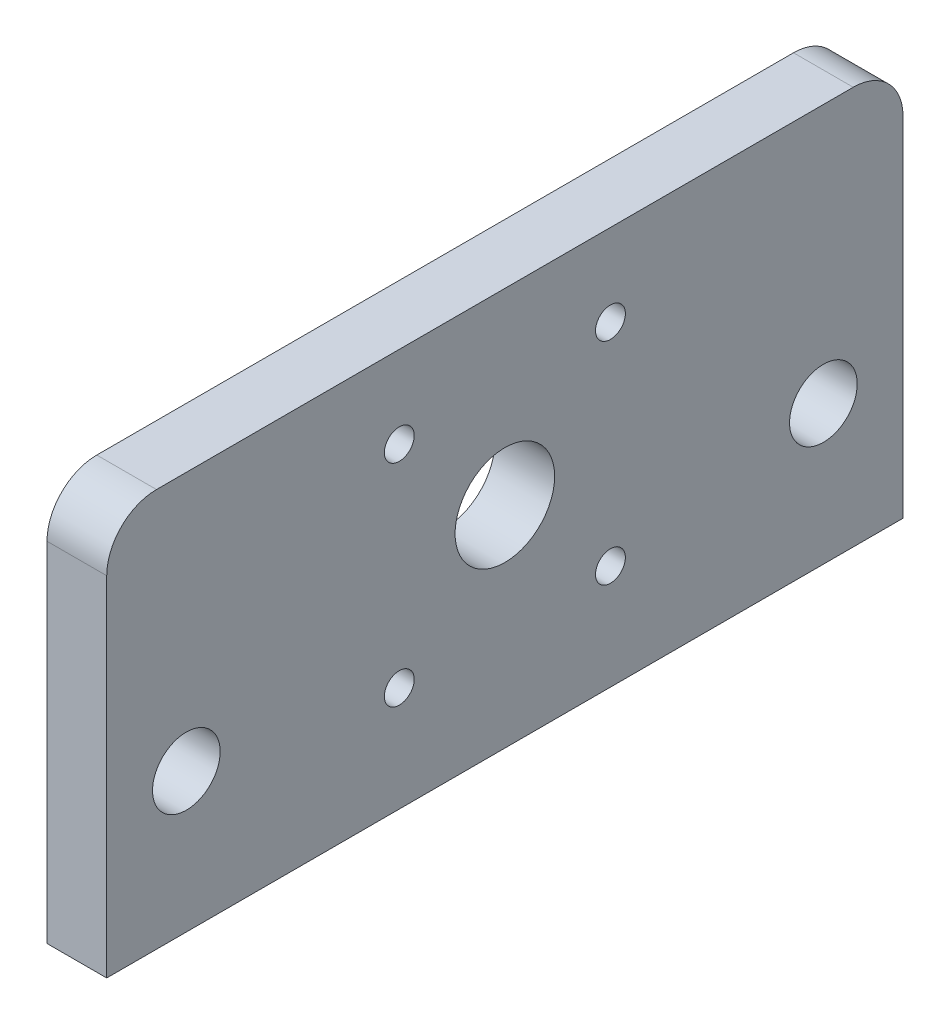
ISO-10303-21;
HEADER;
FILE_DESCRIPTION(('STEP AP214'),'2;1');
FILE_NAME('part.step','',(''),(''),'','','');
FILE_SCHEMA(('AUTOMOTIVE_DESIGN { 1 0 10303 214 1 1 1 1 }'));
ENDSEC;
DATA;
#1=APPLICATION_CONTEXT('core data for automotive mechanical design processes');
#2=APPLICATION_PROTOCOL_DEFINITION('international standard','automotive_design',2000,#1);
#3=PRODUCT_CONTEXT('',#1,'mechanical');
#4=PRODUCT('Part','Part','',(#3));
#5=PRODUCT_RELATED_PRODUCT_CATEGORY('part','',(#4));
#6=PRODUCT_DEFINITION_FORMATION('','',#4);
#7=PRODUCT_DEFINITION_CONTEXT('part definition',#1,'design');
#8=PRODUCT_DEFINITION('design','',#6,#7);
#9=PRODUCT_DEFINITION_SHAPE('','',#8);
#10=(LENGTH_UNIT() NAMED_UNIT(*) SI_UNIT(.MILLI.,.METRE.));
#11=(NAMED_UNIT(*) PLANE_ANGLE_UNIT() SI_UNIT($,.RADIAN.));
#12=(NAMED_UNIT(*) SI_UNIT($,.STERADIAN.) SOLID_ANGLE_UNIT());
#13=UNCERTAINTY_MEASURE_WITH_UNIT(LENGTH_MEASURE(1.E-05),#10,'distance_accuracy_value','');
#14=(GEOMETRIC_REPRESENTATION_CONTEXT(3) GLOBAL_UNCERTAINTY_ASSIGNED_CONTEXT((#13)) GLOBAL_UNIT_ASSIGNED_CONTEXT((#10,
#11,#12)) REPRESENTATION_CONTEXT('',''));
#15=CARTESIAN_POINT('',(0.,0.,0.));
#16=DIRECTION('',(0.,0.,1.));
#17=DIRECTION('',(1.,0.,0.));
#18=AXIS2_PLACEMENT_3D('',#15,#16,#17);
#19=CARTESIAN_POINT('',(-6.,20.,-40.));
#20=DIRECTION('',(0.,0.,-1.));
#21=DIRECTION('',(0.,1.,0.));
#22=AXIS2_PLACEMENT_3D('',#19,#20,#21);
#23=PLANE('',#22);
#24=DIRECTION('',(0.,1.,0.));
#25=VECTOR('',#24,1.);
#26=CARTESIAN_POINT('',(-6.,20.,-40.));
#27=LINE('',#26,#25);
#28=CARTESIAN_POINT('',(-6.,-20.,-40.));
#29=VERTEX_POINT('',#28);
#30=CARTESIAN_POINT('',(-6.,15.,-40.));
#31=VERTEX_POINT('',#30);
#32=EDGE_CURVE('E108',#29,#31,#27,.T.);
#33=ORIENTED_EDGE('',*,*,#32,.T.);
#34=DIRECTION('',(1.,0.,0.));
#35=VECTOR('',#34,1.);
#36=CARTESIAN_POINT('',(-6.,15.,-40.));
#37=LINE('',#36,#35);
#38=CARTESIAN_POINT('',(0.,15.,-40.));
#39=VERTEX_POINT('',#38);
#40=EDGE_CURVE('E122',#31,#39,#37,.T.);
#41=ORIENTED_EDGE('',*,*,#40,.T.);
#42=DIRECTION('',(0.,1.,0.));
#43=VECTOR('',#42,1.);
#44=CARTESIAN_POINT('',(0.,20.,-40.));
#45=LINE('',#44,#43);
#46=CARTESIAN_POINT('',(0.,-20.,-40.));
#47=VERTEX_POINT('',#46);
#48=EDGE_CURVE('E112',#47,#39,#45,.T.);
#49=ORIENTED_EDGE('',*,*,#48,.F.);
#50=DIRECTION('',(1.,0.,0.));
#51=VECTOR('',#50,1.);
#52=CARTESIAN_POINT('',(-6.,-20.,-40.));
#53=LINE('',#52,#51);
#54=EDGE_CURVE('E103',#29,#47,#53,.T.);
#55=ORIENTED_EDGE('',*,*,#54,.F.);
#56=EDGE_LOOP('',(#33,#41,#49,#55));
#57=FACE_BOUND('',#56,.T.);
#58=ADVANCED_FACE('F38',(#57),#23,.T.);
#59=CARTESIAN_POINT('',(-6.,-20.,40.));
#60=DIRECTION('',(0.,-1.,0.));
#61=DIRECTION('',(0.,0.,-1.));
#62=AXIS2_PLACEMENT_3D('',#59,#60,#61);
#63=PLANE('',#62);
#64=DIRECTION('',(0.,0.,-1.));
#65=VECTOR('',#64,1.);
#66=CARTESIAN_POINT('',(0.,-20.,40.));
#67=LINE('',#66,#65);
#68=CARTESIAN_POINT('',(0.,-20.,40.));
#69=VERTEX_POINT('',#68);
#70=EDGE_CURVE('E102',#69,#47,#67,.T.);
#71=ORIENTED_EDGE('',*,*,#70,.F.);
#72=DIRECTION('',(1.,0.,0.));
#73=VECTOR('',#72,1.);
#74=CARTESIAN_POINT('',(-6.,-20.,40.));
#75=LINE('',#74,#73);
#76=CARTESIAN_POINT('',(-6.,-20.,40.));
#77=VERTEX_POINT('',#76);
#78=EDGE_CURVE('E92',#77,#69,#75,.T.);
#79=ORIENTED_EDGE('',*,*,#78,.F.);
#80=DIRECTION('',(0.,0.,-1.));
#81=VECTOR('',#80,1.);
#82=CARTESIAN_POINT('',(-6.,-20.,40.));
#83=LINE('',#82,#81);
#84=EDGE_CURVE('E95',#77,#29,#83,.T.);
#85=ORIENTED_EDGE('',*,*,#84,.T.);
#86=ORIENTED_EDGE('',*,*,#54,.T.);
#87=EDGE_LOOP('',(#71,#79,#85,#86));
#88=FACE_BOUND('',#87,.T.);
#89=ADVANCED_FACE('F100',(#88),#63,.T.);
#90=CARTESIAN_POINT('',(-6.,20.,40.));
#91=DIRECTION('',(0.,0.,1.));
#92=DIRECTION('',(0.,-1.,0.));
#93=AXIS2_PLACEMENT_3D('',#90,#91,#92);
#94=PLANE('',#93);
#95=DIRECTION('',(0.,-1.,0.));
#96=VECTOR('',#95,1.);
#97=CARTESIAN_POINT('',(0.,20.,40.));
#98=LINE('',#97,#96);
#99=CARTESIAN_POINT('',(0.,15.,40.));
#100=VERTEX_POINT('',#99);
#101=EDGE_CURVE('E119',#100,#69,#98,.T.);
#102=ORIENTED_EDGE('',*,*,#101,.F.);
#103=DIRECTION('',(1.,0.,0.));
#104=VECTOR('',#103,1.);
#105=CARTESIAN_POINT('',(-6.,15.,40.));
#106=LINE('',#105,#104);
#107=CARTESIAN_POINT('',(-6.,15.,40.));
#108=VERTEX_POINT('',#107);
#109=EDGE_CURVE('E11',#100,#108,#106,.F.);
#110=ORIENTED_EDGE('',*,*,#109,.T.);
#111=DIRECTION('',(0.,-1.,0.));
#112=VECTOR('',#111,1.);
#113=CARTESIAN_POINT('',(-6.,20.,40.));
#114=LINE('',#113,#112);
#115=EDGE_CURVE('E89',#108,#77,#114,.T.);
#116=ORIENTED_EDGE('',*,*,#115,.T.);
#117=ORIENTED_EDGE('',*,*,#78,.T.);
#118=EDGE_LOOP('',(#102,#110,#116,#117));
#119=FACE_BOUND('',#118,.T.);
#120=ADVANCED_FACE('F91',(#119),#94,.T.);
#121=CARTESIAN_POINT('',(-6.,20.,40.));
#122=DIRECTION('',(0.,1.,0.));
#123=DIRECTION('',(0.,0.,1.));
#124=AXIS2_PLACEMENT_3D('',#121,#122,#123);
#125=PLANE('',#124);
#126=DIRECTION('',(0.,0.,1.));
#127=VECTOR('',#126,1.);
#128=CARTESIAN_POINT('',(0.,20.,40.));
#129=LINE('',#128,#127);
#130=CARTESIAN_POINT('',(0.,20.,-35.));
#131=VERTEX_POINT('',#130);
#132=CARTESIAN_POINT('',(0.,20.,35.));
#133=VERTEX_POINT('',#132);
#134=EDGE_CURVE('E115',#131,#133,#129,.T.);
#135=ORIENTED_EDGE('',*,*,#134,.F.);
#136=DIRECTION('',(1.,0.,0.));
#137=VECTOR('',#136,1.);
#138=CARTESIAN_POINT('',(-6.,20.,-35.));
#139=LINE('',#138,#137);
#140=CARTESIAN_POINT('',(-6.,20.,-35.));
#141=VERTEX_POINT('',#140);
#142=EDGE_CURVE('E133',#131,#141,#139,.F.);
#143=ORIENTED_EDGE('',*,*,#142,.T.);
#144=DIRECTION('',(0.,0.,1.));
#145=VECTOR('',#144,1.);
#146=CARTESIAN_POINT('',(-6.,20.,40.));
#147=LINE('',#146,#145);
#148=CARTESIAN_POINT('',(-6.,20.,35.));
#149=VERTEX_POINT('',#148);
#150=EDGE_CURVE('E96',#141,#149,#147,.T.);
#151=ORIENTED_EDGE('',*,*,#150,.T.);
#152=DIRECTION('',(1.,0.,0.));
#153=VECTOR('',#152,1.);
#154=CARTESIAN_POINT('',(-6.,20.,35.));
#155=LINE('',#154,#153);
#156=EDGE_CURVE('E130',#149,#133,#155,.T.);
#157=ORIENTED_EDGE('',*,*,#156,.T.);
#158=EDGE_LOOP('',(#135,#143,#151,#157));
#159=FACE_BOUND('',#158,.T.);
#160=ADVANCED_FACE('F147',(#159),#125,.T.);
#161=CARTESIAN_POINT('',(-6.,0.,0.));
#162=DIRECTION('',(1.,0.,0.));
#163=DIRECTION('',(0.,0.,-1.));
#164=AXIS2_PLACEMENT_3D('',#161,#162,#163);
#165=PLANE('',#164);
#166=CARTESIAN_POINT('',(-6.,11.7566017177983,10.6066017177982));
#167=DIRECTION('',(1.,0.,0.));
#168=DIRECTION('',(0.,0.,-1.));
#169=AXIS2_PLACEMENT_3D('',#166,#167,#168);
#170=CIRCLE('',#169,1.49999999999996);
#171=CARTESIAN_POINT('',(-6.,11.7566017177983,9.1066017177982));
#172=VERTEX_POINT('',#171);
#173=EDGE_CURVE('E116',#172,#172,#170,.T.);
#174=ORIENTED_EDGE('',*,*,#173,.T.);
#175=EDGE_LOOP('',(#174));
#176=FACE_BOUND('',#175,.T.);
#177=CARTESIAN_POINT('',(-6.,11.7566017177982,-10.6066017177982));
#178=DIRECTION('',(1.,0.,0.));
#179=DIRECTION('',(0.,0.,-1.));
#180=AXIS2_PLACEMENT_3D('',#177,#178,#179);
#181=CIRCLE('',#180,1.5);
#182=CARTESIAN_POINT('',(-6.,11.7566017177982,-12.1066017177982));
#183=VERTEX_POINT('',#182);
#184=EDGE_CURVE('E221',#183,#183,#181,.T.);
#185=ORIENTED_EDGE('',*,*,#184,.T.);
#186=EDGE_LOOP('',(#185));
#187=FACE_BOUND('',#186,.T.);
#188=CARTESIAN_POINT('',(-6.,-9.45660171779821,-10.6066017177982));
#189=DIRECTION('',(1.,0.,0.));
#190=DIRECTION('',(0.,0.,-1.));
#191=AXIS2_PLACEMENT_3D('',#188,#189,#190);
#192=CIRCLE('',#191,1.5);
#193=CARTESIAN_POINT('',(-6.,-9.45660171779821,-12.1066017177982));
#194=VERTEX_POINT('',#193);
#195=EDGE_CURVE('E212',#194,#194,#192,.T.);
#196=ORIENTED_EDGE('',*,*,#195,.T.);
#197=EDGE_LOOP('',(#196));
#198=FACE_BOUND('',#197,.T.);
#199=CARTESIAN_POINT('',(-6.,-9.45660171779823,10.6066017177982));
#200=DIRECTION('',(1.,0.,0.));
#201=DIRECTION('',(0.,0.,-1.));
#202=AXIS2_PLACEMENT_3D('',#199,#200,#201);
#203=CIRCLE('',#202,1.49999999999999);
#204=CARTESIAN_POINT('',(-6.,-9.45660171779823,9.10660171779823));
#205=VERTEX_POINT('',#204);
#206=EDGE_CURVE('E208',#205,#205,#203,.T.);
#207=ORIENTED_EDGE('',*,*,#206,.T.);
#208=EDGE_LOOP('',(#207));
#209=FACE_BOUND('',#208,.T.);
#210=CARTESIAN_POINT('',(-6.,-6.00000000000001,-32.));
#211=DIRECTION('',(1.,0.,0.));
#212=DIRECTION('',(0.,0.,-1.));
#213=AXIS2_PLACEMENT_3D('',#210,#211,#212);
#214=CIRCLE('',#213,3.4);
#215=CARTESIAN_POINT('',(-6.,-6.00000000000001,-35.4));
#216=VERTEX_POINT('',#215);
#217=EDGE_CURVE('E206',#216,#216,#214,.T.);
#218=ORIENTED_EDGE('',*,*,#217,.T.);
#219=EDGE_LOOP('',(#218));
#220=FACE_BOUND('',#219,.T.);
#221=CARTESIAN_POINT('',(-6.,-6.00000000000001,32.));
#222=DIRECTION('',(1.,0.,0.));
#223=DIRECTION('',(0.,0.,-1.));
#224=AXIS2_PLACEMENT_3D('',#221,#222,#223);
#225=CIRCLE('',#224,3.4);
#226=CARTESIAN_POINT('',(-6.,-6.00000000000001,28.6));
#227=VERTEX_POINT('',#226);
#228=EDGE_CURVE('E209',#227,#227,#225,.T.);
#229=ORIENTED_EDGE('',*,*,#228,.T.);
#230=EDGE_LOOP('',(#229));
#231=FACE_BOUND('',#230,.T.);
#232=CARTESIAN_POINT('',(-6.,1.14999999999999,0.));
#233=DIRECTION('',(1.,0.,0.));
#234=DIRECTION('',(0.,0.,-1.));
#235=AXIS2_PLACEMENT_3D('',#232,#233,#234);
#236=CIRCLE('',#235,5.);
#237=CARTESIAN_POINT('',(-6.,1.14999999999999,-4.99999999999999));
#238=VERTEX_POINT('',#237);
#239=EDGE_CURVE('E215',#238,#238,#236,.T.);
#240=ORIENTED_EDGE('',*,*,#239,.T.);
#241=EDGE_LOOP('',(#240));
#242=FACE_BOUND('',#241,.T.);
#243=ORIENTED_EDGE('',*,*,#150,.F.);
#244=CARTESIAN_POINT('',(-6.,15.,-35.));
#245=DIRECTION('',(1.,0.,0.));
#246=DIRECTION('',(0.,0.,-1.));
#247=AXIS2_PLACEMENT_3D('',#244,#245,#246);
#248=CIRCLE('',#247,5.);
#249=EDGE_CURVE('E46',#141,#31,#248,.F.);
#250=ORIENTED_EDGE('',*,*,#249,.T.);
#251=ORIENTED_EDGE('',*,*,#32,.F.);
#252=ORIENTED_EDGE('',*,*,#84,.F.);
#253=ORIENTED_EDGE('',*,*,#115,.F.);
#254=CARTESIAN_POINT('',(-6.,15.,35.));
#255=DIRECTION('',(1.,0.,0.));
#256=DIRECTION('',(0.,0.,-1.));
#257=AXIS2_PLACEMENT_3D('',#254,#255,#256);
#258=CIRCLE('',#257,5.);
#259=EDGE_CURVE('E58',#108,#149,#258,.F.);
#260=ORIENTED_EDGE('',*,*,#259,.T.);
#261=EDGE_LOOP('',(#243,#250,#251,#252,#253,#260));
#262=FACE_BOUND('',#261,.T.);
#263=ADVANCED_FACE('F106',(#176,#187,#198,#209,#220,#231,#242,#262),#165,.F.);
#264=CARTESIAN_POINT('',(0.,0.,0.));
#265=DIRECTION('',(1.,0.,0.));
#266=DIRECTION('',(0.,0.,-1.));
#267=AXIS2_PLACEMENT_3D('',#264,#265,#266);
#268=PLANE('',#267);
#269=CARTESIAN_POINT('',(0.,11.7566017177983,10.6066017177982));
#270=DIRECTION('',(1.,0.,0.));
#271=DIRECTION('',(0.,0.,-1.));
#272=AXIS2_PLACEMENT_3D('',#269,#270,#271);
#273=CIRCLE('',#272,1.49999999999996);
#274=CARTESIAN_POINT('',(0.,11.7566017177983,9.1066017177982));
#275=VERTEX_POINT('',#274);
#276=EDGE_CURVE('E241',#275,#275,#273,.T.);
#277=ORIENTED_EDGE('',*,*,#276,.F.);
#278=EDGE_LOOP('',(#277));
#279=FACE_BOUND('',#278,.T.);
#280=CARTESIAN_POINT('',(0.,11.7566017177982,-10.6066017177982));
#281=DIRECTION('',(1.,0.,0.));
#282=DIRECTION('',(0.,0.,1.));
#283=AXIS2_PLACEMENT_3D('',#280,#281,#282);
#284=CIRCLE('',#283,1.5);
#285=CARTESIAN_POINT('',(0.,11.7566017177982,-9.10660171779819));
#286=VERTEX_POINT('',#285);
#287=EDGE_CURVE('E250',#286,#286,#284,.T.);
#288=ORIENTED_EDGE('',*,*,#287,.F.);
#289=EDGE_LOOP('',(#288));
#290=FACE_BOUND('',#289,.T.);
#291=CARTESIAN_POINT('',(0.,-9.45660171779821,-10.6066017177982));
#292=DIRECTION('',(1.,0.,0.));
#293=DIRECTION('',(0.,0.,-1.));
#294=AXIS2_PLACEMENT_3D('',#291,#292,#293);
#295=CIRCLE('',#294,1.5);
#296=CARTESIAN_POINT('',(0.,-9.45660171779821,-12.1066017177982));
#297=VERTEX_POINT('',#296);
#298=EDGE_CURVE('E247',#297,#297,#295,.T.);
#299=ORIENTED_EDGE('',*,*,#298,.F.);
#300=EDGE_LOOP('',(#299));
#301=FACE_BOUND('',#300,.T.);
#302=CARTESIAN_POINT('',(0.,-9.45660171779823,10.6066017177982));
#303=DIRECTION('',(1.,0.,0.));
#304=DIRECTION('',(0.,0.,1.));
#305=AXIS2_PLACEMENT_3D('',#302,#303,#304);
#306=CIRCLE('',#305,1.49999999999999);
#307=CARTESIAN_POINT('',(0.,-9.45660171779823,12.1066017177982));
#308=VERTEX_POINT('',#307);
#309=EDGE_CURVE('E244',#308,#308,#306,.T.);
#310=ORIENTED_EDGE('',*,*,#309,.F.);
#311=EDGE_LOOP('',(#310));
#312=FACE_BOUND('',#311,.T.);
#313=CARTESIAN_POINT('',(0.,-6.00000000000001,-32.));
#314=DIRECTION('',(1.,0.,0.));
#315=DIRECTION('',(0.,0.,-1.));
#316=AXIS2_PLACEMENT_3D('',#313,#314,#315);
#317=CIRCLE('',#316,3.4);
#318=CARTESIAN_POINT('',(0.,-6.00000000000001,-35.4));
#319=VERTEX_POINT('',#318);
#320=EDGE_CURVE('E203',#319,#319,#317,.T.);
#321=ORIENTED_EDGE('',*,*,#320,.F.);
#322=EDGE_LOOP('',(#321));
#323=FACE_BOUND('',#322,.T.);
#324=CARTESIAN_POINT('',(0.,-6.00000000000001,32.));
#325=DIRECTION('',(1.,0.,0.));
#326=DIRECTION('',(0.,0.,-1.));
#327=AXIS2_PLACEMENT_3D('',#324,#325,#326);
#328=CIRCLE('',#327,3.4);
#329=CARTESIAN_POINT('',(0.,-6.00000000000001,28.6));
#330=VERTEX_POINT('',#329);
#331=EDGE_CURVE('E255',#330,#330,#328,.T.);
#332=ORIENTED_EDGE('',*,*,#331,.F.);
#333=EDGE_LOOP('',(#332));
#334=FACE_BOUND('',#333,.T.);
#335=CARTESIAN_POINT('',(0.,1.14999999999999,0.));
#336=DIRECTION('',(1.,0.,0.));
#337=DIRECTION('',(0.,0.,-1.));
#338=AXIS2_PLACEMENT_3D('',#335,#336,#337);
#339=CIRCLE('',#338,5.);
#340=CARTESIAN_POINT('',(0.,1.14999999999999,-4.99999999999999));
#341=VERTEX_POINT('',#340);
#342=EDGE_CURVE('E239',#341,#341,#339,.T.);
#343=ORIENTED_EDGE('',*,*,#342,.F.);
#344=EDGE_LOOP('',(#343));
#345=FACE_BOUND('',#344,.T.);
#346=ORIENTED_EDGE('',*,*,#48,.T.);
#347=CARTESIAN_POINT('',(0.,15.,-35.));
#348=DIRECTION('',(1.,0.,0.));
#349=DIRECTION('',(0.,0.,-1.));
#350=AXIS2_PLACEMENT_3D('',#347,#348,#349);
#351=CIRCLE('',#350,5.);
#352=EDGE_CURVE('E128',#39,#131,#351,.T.);
#353=ORIENTED_EDGE('',*,*,#352,.T.);
#354=ORIENTED_EDGE('',*,*,#134,.T.);
#355=CARTESIAN_POINT('',(0.,15.,35.));
#356=DIRECTION('',(1.,0.,0.));
#357=DIRECTION('',(0.,0.,-1.));
#358=AXIS2_PLACEMENT_3D('',#355,#356,#357);
#359=CIRCLE('',#358,5.);
#360=EDGE_CURVE('E126',#133,#100,#359,.T.);
#361=ORIENTED_EDGE('',*,*,#360,.T.);
#362=ORIENTED_EDGE('',*,*,#101,.T.);
#363=ORIENTED_EDGE('',*,*,#70,.T.);
#364=EDGE_LOOP('',(#346,#353,#354,#361,#362,#363));
#365=FACE_BOUND('',#364,.T.);
#366=ADVANCED_FACE('F145',(#279,#290,#301,#312,#323,#334,#345,#365),#268,.T.);
#367=CARTESIAN_POINT('',(-8.,1.14999999999999,0.));
#368=DIRECTION('',(1.,0.,0.));
#369=DIRECTION('',(0.,0.,-1.));
#370=AXIS2_PLACEMENT_3D('',#367,#368,#369);
#371=CYLINDRICAL_SURFACE('',#370,5.);
#372=ORIENTED_EDGE('',*,*,#342,.T.);
#373=EDGE_LOOP('',(#372));
#374=FACE_BOUND('',#373,.T.);
#375=ORIENTED_EDGE('',*,*,#239,.F.);
#376=EDGE_LOOP('',(#375));
#377=FACE_BOUND('',#376,.T.);
#378=ADVANCED_FACE('F168',(#374,#377),#371,.F.);
#379=CARTESIAN_POINT('',(-8.,-6.00000000000001,32.));
#380=DIRECTION('',(1.,0.,0.));
#381=DIRECTION('',(0.,0.,-1.));
#382=AXIS2_PLACEMENT_3D('',#379,#380,#381);
#383=CYLINDRICAL_SURFACE('',#382,3.4);
#384=ORIENTED_EDGE('',*,*,#331,.T.);
#385=EDGE_LOOP('',(#384));
#386=FACE_BOUND('',#385,.T.);
#387=ORIENTED_EDGE('',*,*,#228,.F.);
#388=EDGE_LOOP('',(#387));
#389=FACE_BOUND('',#388,.T.);
#390=ADVANCED_FACE('F175',(#386,#389),#383,.F.);
#391=CARTESIAN_POINT('',(-8.,-6.00000000000001,-32.));
#392=DIRECTION('',(1.,0.,0.));
#393=DIRECTION('',(0.,0.,-1.));
#394=AXIS2_PLACEMENT_3D('',#391,#392,#393);
#395=CYLINDRICAL_SURFACE('',#394,3.4);
#396=ORIENTED_EDGE('',*,*,#320,.T.);
#397=EDGE_LOOP('',(#396));
#398=FACE_BOUND('',#397,.T.);
#399=ORIENTED_EDGE('',*,*,#217,.F.);
#400=EDGE_LOOP('',(#399));
#401=FACE_BOUND('',#400,.T.);
#402=ADVANCED_FACE('F181',(#398,#401),#395,.F.);
#403=CARTESIAN_POINT('',(-8.,-9.45660171779823,10.6066017177982));
#404=DIRECTION('',(1.,0.,0.));
#405=DIRECTION('',(0.,0.,-1.));
#406=AXIS2_PLACEMENT_3D('',#403,#404,#405);
#407=CYLINDRICAL_SURFACE('',#406,1.49999999999999);
#408=ORIENTED_EDGE('',*,*,#309,.T.);
#409=EDGE_LOOP('',(#408));
#410=FACE_BOUND('',#409,.T.);
#411=ORIENTED_EDGE('',*,*,#206,.F.);
#412=EDGE_LOOP('',(#411));
#413=FACE_BOUND('',#412,.T.);
#414=ADVANCED_FACE('F177',(#410,#413),#407,.F.);
#415=CARTESIAN_POINT('',(-8.,-9.45660171779821,-10.6066017177982));
#416=DIRECTION('',(1.,0.,0.));
#417=DIRECTION('',(0.,0.,-1.));
#418=AXIS2_PLACEMENT_3D('',#415,#416,#417);
#419=CYLINDRICAL_SURFACE('',#418,1.5);
#420=ORIENTED_EDGE('',*,*,#298,.T.);
#421=EDGE_LOOP('',(#420));
#422=FACE_BOUND('',#421,.T.);
#423=ORIENTED_EDGE('',*,*,#195,.F.);
#424=EDGE_LOOP('',(#423));
#425=FACE_BOUND('',#424,.T.);
#426=ADVANCED_FACE('F180',(#422,#425),#419,.F.);
#427=CARTESIAN_POINT('',(-8.,11.7566017177982,-10.6066017177982));
#428=DIRECTION('',(1.,0.,0.));
#429=DIRECTION('',(0.,0.,-1.));
#430=AXIS2_PLACEMENT_3D('',#427,#428,#429);
#431=CYLINDRICAL_SURFACE('',#430,1.5);
#432=ORIENTED_EDGE('',*,*,#287,.T.);
#433=EDGE_LOOP('',(#432));
#434=FACE_BOUND('',#433,.T.);
#435=ORIENTED_EDGE('',*,*,#184,.F.);
#436=EDGE_LOOP('',(#435));
#437=FACE_BOUND('',#436,.T.);
#438=ADVANCED_FACE('F185',(#434,#437),#431,.F.);
#439=CARTESIAN_POINT('',(-8.,11.7566017177983,10.6066017177982));
#440=DIRECTION('',(1.,0.,0.));
#441=DIRECTION('',(0.,0.,-1.));
#442=AXIS2_PLACEMENT_3D('',#439,#440,#441);
#443=CYLINDRICAL_SURFACE('',#442,1.49999999999996);
#444=ORIENTED_EDGE('',*,*,#276,.T.);
#445=EDGE_LOOP('',(#444));
#446=FACE_BOUND('',#445,.T.);
#447=ORIENTED_EDGE('',*,*,#173,.F.);
#448=EDGE_LOOP('',(#447));
#449=FACE_BOUND('',#448,.T.);
#450=ADVANCED_FACE('F154',(#446,#449),#443,.F.);
#451=CARTESIAN_POINT('',(-6.,15.,-35.));
#452=DIRECTION('',(1.,0.,0.));
#453=DIRECTION('',(0.,0.,-1.));
#454=AXIS2_PLACEMENT_3D('',#451,#452,#453);
#455=CYLINDRICAL_SURFACE('',#454,5.);
#456=ORIENTED_EDGE('',*,*,#249,.F.);
#457=ORIENTED_EDGE('',*,*,#142,.F.);
#458=ORIENTED_EDGE('',*,*,#352,.F.);
#459=ORIENTED_EDGE('',*,*,#40,.F.);
#460=EDGE_LOOP('',(#456,#457,#458,#459));
#461=FACE_BOUND('',#460,.T.);
#462=ADVANCED_FACE('F142',(#461),#455,.T.);
#463=CARTESIAN_POINT('',(-6.,15.,35.));
#464=DIRECTION('',(1.,0.,0.));
#465=DIRECTION('',(0.,0.,-1.));
#466=AXIS2_PLACEMENT_3D('',#463,#464,#465);
#467=CYLINDRICAL_SURFACE('',#466,5.);
#468=ORIENTED_EDGE('',*,*,#259,.F.);
#469=ORIENTED_EDGE('',*,*,#109,.F.);
#470=ORIENTED_EDGE('',*,*,#360,.F.);
#471=ORIENTED_EDGE('',*,*,#156,.F.);
#472=EDGE_LOOP('',(#468,#469,#470,#471));
#473=FACE_BOUND('',#472,.T.);
#474=ADVANCED_FACE('F40',(#473),#467,.T.);
#475=CLOSED_SHELL('',(#58,#89,#120,#160,#263,#366,#378,#390,#402,#414,#426,#438,#450,#462,#474));
#476=MANIFOLD_SOLID_BREP('B2',#475);
#477=ADVANCED_BREP_SHAPE_REPRESENTATION('',(#18,#476),#14);
#478=SHAPE_DEFINITION_REPRESENTATION(#9,#477);
ENDSEC;
END-ISO-10303-21;
